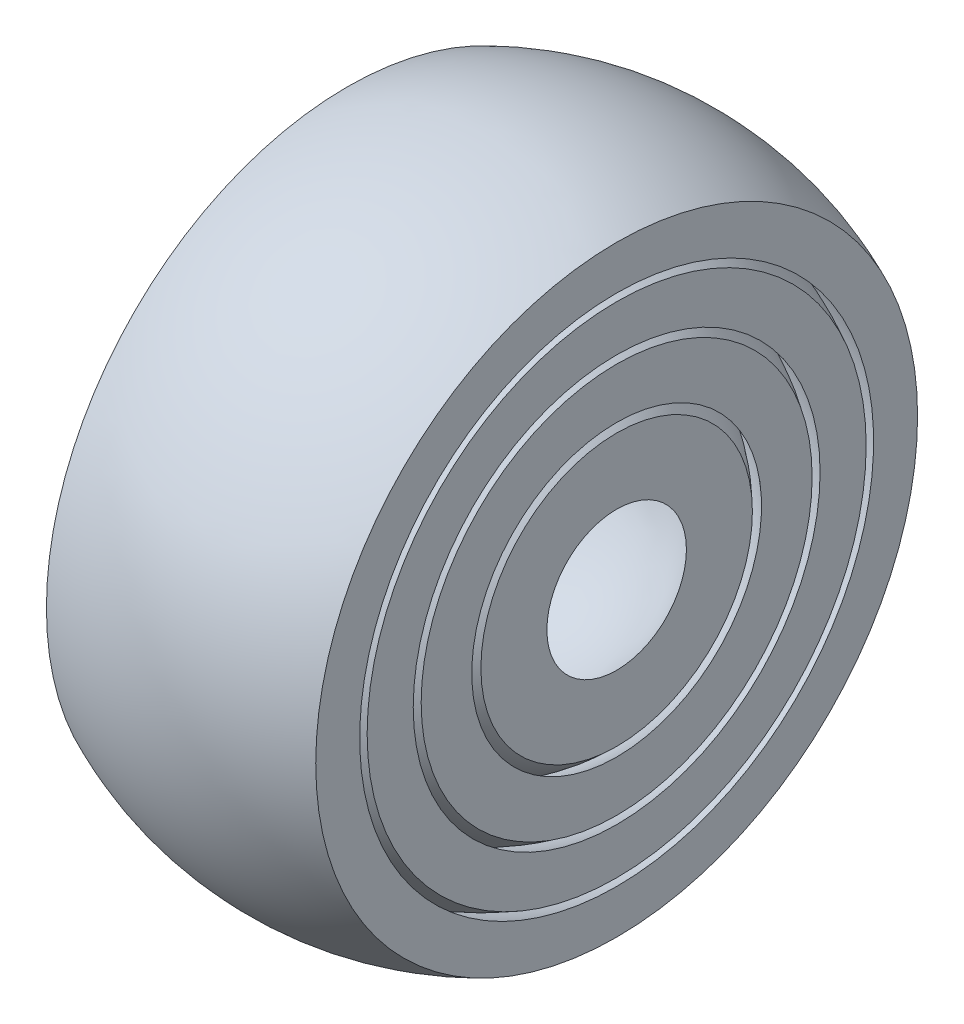
ISO-10303-21;
HEADER;
FILE_DESCRIPTION(('STEP AP214'),'2;1');
FILE_NAME('part.step','',(''),(''),'','','');
FILE_SCHEMA(('AUTOMOTIVE_DESIGN { 1 0 10303 214 1 1 1 1 }'));
ENDSEC;
DATA;
#1=APPLICATION_CONTEXT('core data for automotive mechanical design processes');
#2=APPLICATION_PROTOCOL_DEFINITION('international standard','automotive_design',2000,#1);
#3=PRODUCT_CONTEXT('',#1,'mechanical');
#4=PRODUCT('Part','Part','',(#3));
#5=PRODUCT_RELATED_PRODUCT_CATEGORY('part','',(#4));
#6=PRODUCT_DEFINITION_FORMATION('','',#4);
#7=PRODUCT_DEFINITION_CONTEXT('part definition',#1,'design');
#8=PRODUCT_DEFINITION('design','',#6,#7);
#9=PRODUCT_DEFINITION_SHAPE('','',#8);
#10=(LENGTH_UNIT() NAMED_UNIT(*) SI_UNIT(.MILLI.,.METRE.));
#11=(NAMED_UNIT(*) PLANE_ANGLE_UNIT() SI_UNIT($,.RADIAN.));
#12=(NAMED_UNIT(*) SI_UNIT($,.STERADIAN.) SOLID_ANGLE_UNIT());
#13=UNCERTAINTY_MEASURE_WITH_UNIT(LENGTH_MEASURE(1.E-05),#10,'distance_accuracy_value','');
#14=(GEOMETRIC_REPRESENTATION_CONTEXT(3) GLOBAL_UNCERTAINTY_ASSIGNED_CONTEXT((#13)) GLOBAL_UNIT_ASSIGNED_CONTEXT((#10,
#11,#12)) REPRESENTATION_CONTEXT('',''));
#15=CARTESIAN_POINT('',(0.,0.,0.));
#16=DIRECTION('',(0.,0.,1.));
#17=DIRECTION('',(1.,0.,0.));
#18=AXIS2_PLACEMENT_3D('',#15,#16,#17);
#19=CARTESIAN_POINT('',(0.,0.,0.));
#20=DIRECTION('',(0.,1.,0.));
#21=DIRECTION('',(-1.,0.,0.));
#22=AXIS2_PLACEMENT_3D('',#19,#20,#21);
#23=SPHERICAL_SURFACE('',#22,23.);
#24=CARTESIAN_POINT('',(0.,0.,0.));
#25=DIRECTION('',(1.,0.,0.));
#26=DIRECTION('',(0.,1.,0.));
#27=AXIS2_PLACEMENT_3D('',#24,#25,#26);
#28=SPHERICAL_SURFACE('',#27,23.);
#29=CARTESIAN_POINT('',(-20.4220408552372,0.,0.));
#30=DIRECTION('',(1.,0.,0.));
#31=DIRECTION('',(0.,1.,0.));
#32=AXIS2_PLACEMENT_3D('',#29,#30,#31);
#33=CIRCLE('',#32,10.5801818182403);
#34=CARTESIAN_POINT('',(-20.4220408552372,10.5801818182403,0.));
#35=VERTEX_POINT('',#34);
#36=EDGE_CURVE('E43',#35,#35,#33,.T.);
#37=ORIENTED_EDGE('',*,*,#36,.F.);
#38=EDGE_LOOP('',(#37));
#39=FACE_BOUND('',#38,.T.);
#40=CARTESIAN_POINT('',(20.4220408552372,0.,0.));
#41=DIRECTION('',(-1.,0.,0.));
#42=DIRECTION('',(0.,-1.,0.));
#43=AXIS2_PLACEMENT_3D('',#40,#41,#42);
#44=CIRCLE('',#43,10.5801818182403);
#45=CARTESIAN_POINT('',(20.4220408552372,-10.5801818182403,0.));
#46=VERTEX_POINT('',#45);
#47=EDGE_CURVE('E53',#46,#46,#44,.T.);
#48=ORIENTED_EDGE('',*,*,#47,.F.);
#49=EDGE_LOOP('',(#48));
#50=FACE_BOUND('',#49,.T.);
#51=ADVANCED_FACE('F40',(#39,#50),#28,.F.);
#52=CARTESIAN_POINT('',(20.4220408552372,65.1712475216732,-50.));
#53=DIRECTION('',(-1.,0.,0.));
#54=DIRECTION('',(0.,-1.,0.));
#55=AXIS2_PLACEMENT_3D('',#52,#53,#54);
#56=PLANE('',#55);
#57=CARTESIAN_POINT('',(20.4220408552372,0.,0.));
#58=DIRECTION('',(-1.,0.,0.));
#59=DIRECTION('',(0.,-1.,0.));
#60=AXIS2_PLACEMENT_3D('',#57,#58,#59);
#61=CIRCLE('',#60,20.589809307204);
#62=CARTESIAN_POINT('',(20.4220408552372,-20.589809307204,0.));
#63=VERTEX_POINT('',#62);
#64=EDGE_CURVE('E51',#63,#63,#61,.F.);
#65=ORIENTED_EDGE('',*,*,#64,.T.);
#66=EDGE_LOOP('',(#65));
#67=FACE_BOUND('',#66,.T.);
#68=ORIENTED_EDGE('',*,*,#47,.T.);
#69=EDGE_LOOP('',(#68));
#70=FACE_BOUND('',#69,.T.);
#71=ADVANCED_FACE('F60',(#67,#70),#56,.F.);
#72=CARTESIAN_POINT('',(-20.4220408552372,65.1712475216732,-50.));
#73=DIRECTION('',(1.,0.,0.));
#74=DIRECTION('',(0.,1.,0.));
#75=AXIS2_PLACEMENT_3D('',#72,#73,#74);
#76=PLANE('',#75);
#77=CARTESIAN_POINT('',(-20.4220408552372,0.,0.));
#78=DIRECTION('',(1.,0.,0.));
#79=DIRECTION('',(0.,1.,0.));
#80=AXIS2_PLACEMENT_3D('',#77,#78,#79);
#81=CIRCLE('',#80,20.589809307204);
#82=CARTESIAN_POINT('',(-20.4220408552372,20.589809307204,0.));
#83=VERTEX_POINT('',#82);
#84=EDGE_CURVE('E11',#83,#83,#81,.F.);
#85=ORIENTED_EDGE('',*,*,#84,.T.);
#86=EDGE_LOOP('',(#85));
#87=FACE_BOUND('',#86,.T.);
#88=ORIENTED_EDGE('',*,*,#36,.T.);
#89=EDGE_LOOP('',(#88));
#90=FACE_BOUND('',#89,.T.);
#91=ADVANCED_FACE('F64',(#87,#90),#76,.F.);
#92=CARTESIAN_POINT('',(0.,0.,0.));
#93=DIRECTION('',(0.,1.,0.));
#94=DIRECTION('',(1.,0.,0.));
#95=AXIS2_PLACEMENT_3D('',#92,#93,#94);
#96=SPHERICAL_SURFACE('',#95,29.);
#97=CARTESIAN_POINT('',(0.,0.,0.));
#98=DIRECTION('',(1.,0.,0.));
#99=DIRECTION('',(0.,1.,0.));
#100=AXIS2_PLACEMENT_3D('',#97,#98,#99);
#101=SPHERICAL_SURFACE('',#100,29.);
#102=ORIENTED_EDGE('',*,*,#84,.F.);
#103=EDGE_LOOP('',(#102));
#104=FACE_BOUND('',#103,.T.);
#105=ORIENTED_EDGE('',*,*,#64,.F.);
#106=EDGE_LOOP('',(#105));
#107=FACE_BOUND('',#106,.T.);
#108=ADVANCED_FACE('F62',(#104,#107),#101,.T.);
#109=CLOSED_SHELL('',(#51,#71,#91,#108));
#110=MANIFOLD_SOLID_BREP('B2',#109);
#111=CARTESIAN_POINT('',(0.,0.,0.));
#112=DIRECTION('',(0.,1.,0.));
#113=DIRECTION('',(-1.,0.,0.));
#114=AXIS2_PLACEMENT_3D('',#111,#112,#113);
#115=SPHERICAL_SURFACE('',#114,30.);
#116=CARTESIAN_POINT('',(0.,0.,0.));
#117=DIRECTION('',(1.,0.,0.));
#118=DIRECTION('',(0.,1.,0.));
#119=AXIS2_PLACEMENT_3D('',#116,#117,#118);
#120=SPHERICAL_SURFACE('',#119,30.);
#121=CARTESIAN_POINT('',(-20.4220408552372,0.,0.));
#122=DIRECTION('',(1.,0.,0.));
#123=DIRECTION('',(0.,1.,0.));
#124=AXIS2_PLACEMENT_3D('',#121,#122,#123);
#125=CIRCLE('',#124,21.9759015129533);
#126=CARTESIAN_POINT('',(-20.4220408552372,21.9759015129533,0.));
#127=VERTEX_POINT('',#126);
#128=EDGE_CURVE('E113',#127,#127,#125,.T.);
#129=ORIENTED_EDGE('',*,*,#128,.F.);
#130=EDGE_LOOP('',(#129));
#131=FACE_BOUND('',#130,.T.);
#132=CARTESIAN_POINT('',(20.4220408552372,0.,0.));
#133=DIRECTION('',(-1.,0.,0.));
#134=DIRECTION('',(0.,-1.,0.));
#135=AXIS2_PLACEMENT_3D('',#132,#133,#134);
#136=CIRCLE('',#135,21.9759015129533);
#137=CARTESIAN_POINT('',(20.4220408552372,-21.9759015129533,0.));
#138=VERTEX_POINT('',#137);
#139=EDGE_CURVE('E123',#138,#138,#136,.T.);
#140=ORIENTED_EDGE('',*,*,#139,.F.);
#141=EDGE_LOOP('',(#140));
#142=FACE_BOUND('',#141,.T.);
#143=ADVANCED_FACE('F110',(#131,#142),#120,.F.);
#144=CARTESIAN_POINT('',(20.4220408552372,65.1712475216732,-50.));
#145=DIRECTION('',(-1.,0.,0.));
#146=DIRECTION('',(0.,-1.,0.));
#147=AXIS2_PLACEMENT_3D('',#144,#145,#146);
#148=PLANE('',#147);
#149=CARTESIAN_POINT('',(20.4220408552372,0.,0.));
#150=DIRECTION('',(-1.,0.,0.));
#151=DIRECTION('',(0.,-1.,0.));
#152=AXIS2_PLACEMENT_3D('',#149,#150,#151);
#153=CIRCLE('',#152,29.6469264394646);
#154=CARTESIAN_POINT('',(20.4220408552372,-29.6469264394646,0.));
#155=VERTEX_POINT('',#154);
#156=EDGE_CURVE('E121',#155,#155,#153,.F.);
#157=ORIENTED_EDGE('',*,*,#156,.T.);
#158=EDGE_LOOP('',(#157));
#159=FACE_BOUND('',#158,.T.);
#160=ORIENTED_EDGE('',*,*,#139,.T.);
#161=EDGE_LOOP('',(#160));
#162=FACE_BOUND('',#161,.T.);
#163=ADVANCED_FACE('F130',(#159,#162),#148,.F.);
#164=CARTESIAN_POINT('',(-20.4220408552372,65.1712475216732,-50.));
#165=DIRECTION('',(1.,0.,0.));
#166=DIRECTION('',(0.,1.,0.));
#167=AXIS2_PLACEMENT_3D('',#164,#165,#166);
#168=PLANE('',#167);
#169=CARTESIAN_POINT('',(-20.4220408552372,0.,0.));
#170=DIRECTION('',(1.,0.,0.));
#171=DIRECTION('',(0.,1.,0.));
#172=AXIS2_PLACEMENT_3D('',#169,#170,#171);
#173=CIRCLE('',#172,29.6469264394646);
#174=CARTESIAN_POINT('',(-20.4220408552372,29.6469264394646,0.));
#175=VERTEX_POINT('',#174);
#176=EDGE_CURVE('E39',#175,#175,#173,.F.);
#177=ORIENTED_EDGE('',*,*,#176,.T.);
#178=EDGE_LOOP('',(#177));
#179=FACE_BOUND('',#178,.T.);
#180=ORIENTED_EDGE('',*,*,#128,.T.);
#181=EDGE_LOOP('',(#180));
#182=FACE_BOUND('',#181,.T.);
#183=ADVANCED_FACE('F134',(#179,#182),#168,.F.);
#184=CARTESIAN_POINT('',(0.,0.,0.));
#185=DIRECTION('',(0.,1.,0.));
#186=DIRECTION('',(1.,0.,0.));
#187=AXIS2_PLACEMENT_3D('',#184,#185,#186);
#188=SPHERICAL_SURFACE('',#187,36.);
#189=CARTESIAN_POINT('',(0.,0.,0.));
#190=DIRECTION('',(1.,0.,0.));
#191=DIRECTION('',(0.,1.,0.));
#192=AXIS2_PLACEMENT_3D('',#189,#190,#191);
#193=SPHERICAL_SURFACE('',#192,36.);
#194=ORIENTED_EDGE('',*,*,#176,.F.);
#195=EDGE_LOOP('',(#194));
#196=FACE_BOUND('',#195,.T.);
#197=ORIENTED_EDGE('',*,*,#156,.F.);
#198=EDGE_LOOP('',(#197));
#199=FACE_BOUND('',#198,.T.);
#200=ADVANCED_FACE('F132',(#196,#199),#193,.T.);
#201=CLOSED_SHELL('',(#143,#163,#183,#200));
#202=MANIFOLD_SOLID_BREP('B6',#201);
#203=CARTESIAN_POINT('',(0.,0.,0.));
#204=DIRECTION('',(0.,1.,0.));
#205=DIRECTION('',(-1.,0.,0.));
#206=AXIS2_PLACEMENT_3D('',#203,#204,#205);
#207=SPHERICAL_SURFACE('',#206,37.);
#208=CARTESIAN_POINT('',(0.,0.,0.));
#209=DIRECTION('',(1.,0.,0.));
#210=DIRECTION('',(0.,1.,0.));
#211=AXIS2_PLACEMENT_3D('',#208,#209,#210);
#212=SPHERICAL_SURFACE('',#211,37.);
#213=CARTESIAN_POINT('',(-20.4220408552372,0.,0.));
#214=DIRECTION('',(1.,0.,0.));
#215=DIRECTION('',(0.,1.,0.));
#216=AXIS2_PLACEMENT_3D('',#213,#214,#215);
#217=CIRCLE('',#216,30.8535289279366);
#218=CARTESIAN_POINT('',(-20.4220408552372,30.8535289279366,0.));
#219=VERTEX_POINT('',#218);
#220=EDGE_CURVE('E182',#219,#219,#217,.T.);
#221=ORIENTED_EDGE('',*,*,#220,.F.);
#222=EDGE_LOOP('',(#221));
#223=FACE_BOUND('',#222,.T.);
#224=CARTESIAN_POINT('',(20.4220408552372,0.,0.));
#225=DIRECTION('',(-1.,0.,0.));
#226=DIRECTION('',(0.,-1.,0.));
#227=AXIS2_PLACEMENT_3D('',#224,#225,#226);
#228=CIRCLE('',#227,30.8535289279366);
#229=CARTESIAN_POINT('',(20.4220408552372,-30.8535289279366,0.));
#230=VERTEX_POINT('',#229);
#231=EDGE_CURVE('E192',#230,#230,#228,.T.);
#232=ORIENTED_EDGE('',*,*,#231,.F.);
#233=EDGE_LOOP('',(#232));
#234=FACE_BOUND('',#233,.T.);
#235=ADVANCED_FACE('F179',(#223,#234),#212,.F.);
#236=CARTESIAN_POINT('',(20.4220408552372,65.1712475216732,-50.));
#237=DIRECTION('',(-1.,0.,0.));
#238=DIRECTION('',(0.,-1.,0.));
#239=AXIS2_PLACEMENT_3D('',#236,#237,#238);
#240=PLANE('',#239);
#241=CARTESIAN_POINT('',(20.4220408552372,0.,0.));
#242=DIRECTION('',(-1.,0.,0.));
#243=DIRECTION('',(0.,-1.,0.));
#244=AXIS2_PLACEMENT_3D('',#241,#242,#243);
#245=CIRCLE('',#244,37.8409863416246);
#246=CARTESIAN_POINT('',(20.4220408552372,-37.8409863416246,0.));
#247=VERTEX_POINT('',#246);
#248=EDGE_CURVE('E190',#247,#247,#245,.F.);
#249=ORIENTED_EDGE('',*,*,#248,.T.);
#250=EDGE_LOOP('',(#249));
#251=FACE_BOUND('',#250,.T.);
#252=ORIENTED_EDGE('',*,*,#231,.T.);
#253=EDGE_LOOP('',(#252));
#254=FACE_BOUND('',#253,.T.);
#255=ADVANCED_FACE('F199',(#251,#254),#240,.F.);
#256=CARTESIAN_POINT('',(-20.4220408552372,65.1712475216732,-50.));
#257=DIRECTION('',(1.,0.,0.));
#258=DIRECTION('',(0.,1.,0.));
#259=AXIS2_PLACEMENT_3D('',#256,#257,#258);
#260=PLANE('',#259);
#261=CARTESIAN_POINT('',(-20.4220408552372,0.,0.));
#262=DIRECTION('',(1.,0.,0.));
#263=DIRECTION('',(0.,1.,0.));
#264=AXIS2_PLACEMENT_3D('',#261,#262,#263);
#265=CIRCLE('',#264,37.8409863416246);
#266=CARTESIAN_POINT('',(-20.4220408552372,37.8409863416246,0.));
#267=VERTEX_POINT('',#266);
#268=EDGE_CURVE('E109',#267,#267,#265,.F.);
#269=ORIENTED_EDGE('',*,*,#268,.T.);
#270=EDGE_LOOP('',(#269));
#271=FACE_BOUND('',#270,.T.);
#272=ORIENTED_EDGE('',*,*,#220,.T.);
#273=EDGE_LOOP('',(#272));
#274=FACE_BOUND('',#273,.T.);
#275=ADVANCED_FACE('F203',(#271,#274),#260,.F.);
#276=CARTESIAN_POINT('',(0.,0.,0.));
#277=DIRECTION('',(0.,1.,0.));
#278=DIRECTION('',(1.,0.,0.));
#279=AXIS2_PLACEMENT_3D('',#276,#277,#278);
#280=SPHERICAL_SURFACE('',#279,43.);
#281=CARTESIAN_POINT('',(0.,0.,0.));
#282=DIRECTION('',(1.,0.,0.));
#283=DIRECTION('',(0.,1.,0.));
#284=AXIS2_PLACEMENT_3D('',#281,#282,#283);
#285=SPHERICAL_SURFACE('',#284,43.);
#286=ORIENTED_EDGE('',*,*,#268,.F.);
#287=EDGE_LOOP('',(#286));
#288=FACE_BOUND('',#287,.T.);
#289=ORIENTED_EDGE('',*,*,#248,.F.);
#290=EDGE_LOOP('',(#289));
#291=FACE_BOUND('',#290,.T.);
#292=ADVANCED_FACE('F201',(#288,#291),#285,.T.);
#293=CLOSED_SHELL('',(#235,#255,#275,#292));
#294=MANIFOLD_SOLID_BREP('B34',#293);
#295=CARTESIAN_POINT('',(0.,0.,0.));
#296=DIRECTION('',(0.,1.,0.));
#297=DIRECTION('',(1.,0.,0.));
#298=AXIS2_PLACEMENT_3D('',#295,#296,#297);
#299=SPHERICAL_SURFACE('',#298,44.);
#300=CARTESIAN_POINT('',(0.,0.,0.));
#301=DIRECTION('',(1.,0.,0.));
#302=DIRECTION('',(0.,1.,0.));
#303=AXIS2_PLACEMENT_3D('',#300,#301,#302);
#304=SPHERICAL_SURFACE('',#303,44.);
#305=CARTESIAN_POINT('',(-20.4220408552372,0.,0.));
#306=DIRECTION('',(1.,0.,0.));
#307=DIRECTION('',(0.,1.,0.));
#308=AXIS2_PLACEMENT_3D('',#305,#306,#307);
#309=CIRCLE('',#308,38.9735839679522);
#310=CARTESIAN_POINT('',(-20.4220408552372,38.9735839679522,0.));
#311=VERTEX_POINT('',#310);
#312=EDGE_CURVE('E244',#311,#311,#309,.T.);
#313=ORIENTED_EDGE('',*,*,#312,.F.);
#314=EDGE_LOOP('',(#313));
#315=FACE_BOUND('',#314,.T.);
#316=CARTESIAN_POINT('',(20.4220408552372,0.,0.));
#317=DIRECTION('',(-1.,0.,0.));
#318=DIRECTION('',(0.,-1.,0.));
#319=AXIS2_PLACEMENT_3D('',#316,#317,#318);
#320=CIRCLE('',#319,38.9735839679522);
#321=CARTESIAN_POINT('',(20.4220408552372,-38.9735839679522,0.));
#322=VERTEX_POINT('',#321);
#323=EDGE_CURVE('E254',#322,#322,#320,.T.);
#324=ORIENTED_EDGE('',*,*,#323,.F.);
#325=EDGE_LOOP('',(#324));
#326=FACE_BOUND('',#325,.T.);
#327=ADVANCED_FACE('F241',(#315,#326),#304,.F.);
#328=CARTESIAN_POINT('',(20.4220408552372,65.1712475216732,-50.));
#329=DIRECTION('',(-1.,0.,0.));
#330=DIRECTION('',(0.,-1.,0.));
#331=AXIS2_PLACEMENT_3D('',#328,#329,#330);
#332=PLANE('',#331);
#333=CARTESIAN_POINT('',(20.4220408552372,0.,0.));
#334=DIRECTION('',(-1.,0.,0.));
#335=DIRECTION('',(0.,-1.,0.));
#336=AXIS2_PLACEMENT_3D('',#333,#334,#335);
#337=CIRCLE('',#336,45.6392402139543);
#338=CARTESIAN_POINT('',(20.4220408552372,-45.6392402139543,0.));
#339=VERTEX_POINT('',#338);
#340=EDGE_CURVE('E252',#339,#339,#337,.F.);
#341=ORIENTED_EDGE('',*,*,#340,.T.);
#342=EDGE_LOOP('',(#341));
#343=FACE_BOUND('',#342,.T.);
#344=ORIENTED_EDGE('',*,*,#323,.T.);
#345=EDGE_LOOP('',(#344));
#346=FACE_BOUND('',#345,.T.);
#347=ADVANCED_FACE('F261',(#343,#346),#332,.F.);
#348=CARTESIAN_POINT('',(-20.4220408552372,65.1712475216732,-50.));
#349=DIRECTION('',(1.,0.,0.));
#350=DIRECTION('',(0.,1.,0.));
#351=AXIS2_PLACEMENT_3D('',#348,#349,#350);
#352=PLANE('',#351);
#353=CARTESIAN_POINT('',(-20.4220408552372,0.,0.));
#354=DIRECTION('',(1.,0.,0.));
#355=DIRECTION('',(0.,1.,0.));
#356=AXIS2_PLACEMENT_3D('',#353,#354,#355);
#357=CIRCLE('',#356,45.6392402139543);
#358=CARTESIAN_POINT('',(-20.4220408552372,45.6392402139543,0.));
#359=VERTEX_POINT('',#358);
#360=EDGE_CURVE('E178',#359,#359,#357,.F.);
#361=ORIENTED_EDGE('',*,*,#360,.T.);
#362=EDGE_LOOP('',(#361));
#363=FACE_BOUND('',#362,.T.);
#364=ORIENTED_EDGE('',*,*,#312,.T.);
#365=EDGE_LOOP('',(#364));
#366=FACE_BOUND('',#365,.T.);
#367=ADVANCED_FACE('F265',(#363,#366),#352,.F.);
#368=CARTESIAN_POINT('',(0.,0.,0.));
#369=DIRECTION('',(0.,1.,0.));
#370=DIRECTION('',(1.,0.,0.));
#371=AXIS2_PLACEMENT_3D('',#368,#369,#370);
#372=SPHERICAL_SURFACE('',#371,50.);
#373=CARTESIAN_POINT('',(0.,0.,0.));
#374=DIRECTION('',(1.,0.,0.));
#375=DIRECTION('',(0.,1.,0.));
#376=AXIS2_PLACEMENT_3D('',#373,#374,#375);
#377=SPHERICAL_SURFACE('',#376,50.);
#378=ORIENTED_EDGE('',*,*,#360,.F.);
#379=EDGE_LOOP('',(#378));
#380=FACE_BOUND('',#379,.T.);
#381=ORIENTED_EDGE('',*,*,#340,.F.);
#382=EDGE_LOOP('',(#381));
#383=FACE_BOUND('',#382,.T.);
#384=ADVANCED_FACE('F263',(#380,#383),#377,.T.);
#385=CLOSED_SHELL('',(#327,#347,#367,#384));
#386=MANIFOLD_SOLID_BREP('B104',#385);
#387=ADVANCED_BREP_SHAPE_REPRESENTATION('',(#18,#110,#202,#294,#386),#14);
#388=SHAPE_DEFINITION_REPRESENTATION(#9,#387);
ENDSEC;
END-ISO-10303-21;
